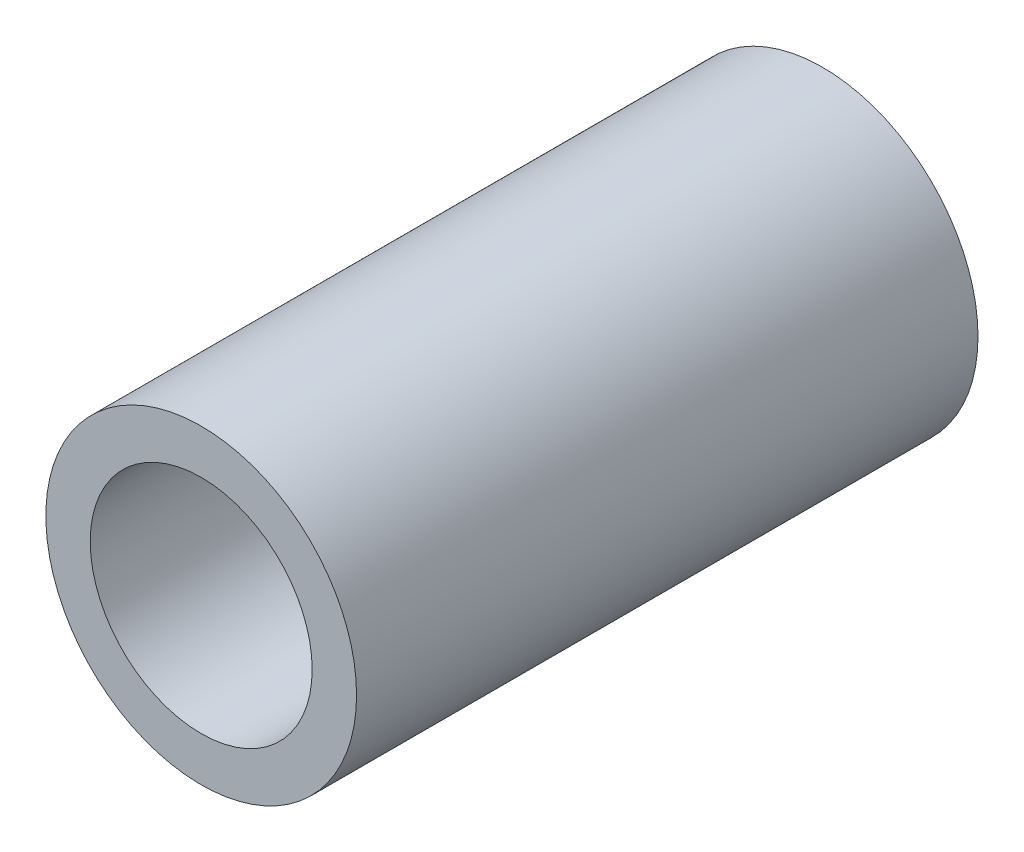
ISO-10303-21;
HEADER;
FILE_DESCRIPTION(('STEP AP214'),'2;1');
FILE_NAME('part.step','',(''),(''),'','','');
FILE_SCHEMA(('AUTOMOTIVE_DESIGN { 1 0 10303 214 1 1 1 1 }'));
ENDSEC;
DATA;
#1=APPLICATION_CONTEXT('core data for automotive mechanical design processes');
#2=APPLICATION_PROTOCOL_DEFINITION('international standard','automotive_design',2000,#1);
#3=PRODUCT_CONTEXT('',#1,'mechanical');
#4=PRODUCT('Part','Part','',(#3));
#5=PRODUCT_RELATED_PRODUCT_CATEGORY('part','',(#4));
#6=PRODUCT_DEFINITION_FORMATION('','',#4);
#7=PRODUCT_DEFINITION_CONTEXT('part definition',#1,'design');
#8=PRODUCT_DEFINITION('design','',#6,#7);
#9=PRODUCT_DEFINITION_SHAPE('','',#8);
#10=(LENGTH_UNIT() NAMED_UNIT(*) SI_UNIT(.MILLI.,.METRE.));
#11=(NAMED_UNIT(*) PLANE_ANGLE_UNIT() SI_UNIT($,.RADIAN.));
#12=(NAMED_UNIT(*) SI_UNIT($,.STERADIAN.) SOLID_ANGLE_UNIT());
#13=UNCERTAINTY_MEASURE_WITH_UNIT(LENGTH_MEASURE(1.E-05),#10,'distance_accuracy_value','');
#14=(GEOMETRIC_REPRESENTATION_CONTEXT(3) GLOBAL_UNCERTAINTY_ASSIGNED_CONTEXT((#13)) GLOBAL_UNIT_ASSIGNED_CONTEXT((#10,
#11,#12)) REPRESENTATION_CONTEXT('',''));
#15=CARTESIAN_POINT('',(0.,0.,0.));
#16=DIRECTION('',(0.,0.,1.));
#17=DIRECTION('',(1.,0.,0.));
#18=AXIS2_PLACEMENT_3D('',#15,#16,#17);
#19=CARTESIAN_POINT('',(0.,0.,-14.));
#20=DIRECTION('',(0.,0.,1.));
#21=DIRECTION('',(1.,0.,0.));
#22=AXIS2_PLACEMENT_3D('',#19,#20,#21);
#23=CYLINDRICAL_SURFACE('',#22,7.);
#24=CARTESIAN_POINT('',(0.,0.,-14.));
#25=DIRECTION('',(0.,0.,1.));
#26=DIRECTION('',(1.,0.,0.));
#27=AXIS2_PLACEMENT_3D('',#24,#25,#26);
#28=CIRCLE('',#27,7.);
#29=CARTESIAN_POINT('',(7.,0.,-14.));
#30=VERTEX_POINT('',#29);
#31=EDGE_CURVE('E10',#30,#30,#28,.T.);
#32=ORIENTED_EDGE('',*,*,#31,.T.);
#33=EDGE_LOOP('',(#32));
#34=FACE_BOUND('',#33,.T.);
#35=CARTESIAN_POINT('',(0.,0.,14.));
#36=DIRECTION('',(0.,0.,1.));
#37=DIRECTION('',(1.,0.,0.));
#38=AXIS2_PLACEMENT_3D('',#35,#36,#37);
#39=CIRCLE('',#38,7.);
#40=CARTESIAN_POINT('',(7.,0.,14.));
#41=VERTEX_POINT('',#40);
#42=EDGE_CURVE('E43',#41,#41,#39,.T.);
#43=ORIENTED_EDGE('',*,*,#42,.F.);
#44=EDGE_LOOP('',(#43));
#45=FACE_BOUND('',#44,.T.);
#46=ADVANCED_FACE('F33',(#34,#45),#23,.T.);
#47=CARTESIAN_POINT('',(0.,0.,-14.));
#48=DIRECTION('',(0.,0.,1.));
#49=DIRECTION('',(1.,0.,0.));
#50=AXIS2_PLACEMENT_3D('',#47,#48,#49);
#51=PLANE('',#50);
#52=CARTESIAN_POINT('',(0.,0.,-14.));
#53=DIRECTION('',(0.,0.,1.));
#54=DIRECTION('',(1.,0.,0.));
#55=AXIS2_PLACEMENT_3D('',#52,#53,#54);
#56=CIRCLE('',#55,5.);
#57=CARTESIAN_POINT('',(5.,0.,-14.));
#58=VERTEX_POINT('',#57);
#59=EDGE_CURVE('E39',#58,#58,#56,.T.);
#60=ORIENTED_EDGE('',*,*,#59,.T.);
#61=EDGE_LOOP('',(#60));
#62=FACE_BOUND('',#61,.T.);
#63=ORIENTED_EDGE('',*,*,#31,.F.);
#64=EDGE_LOOP('',(#63));
#65=FACE_BOUND('',#64,.T.);
#66=ADVANCED_FACE('F62',(#62,#65),#51,.F.);
#67=CARTESIAN_POINT('',(0.,0.,-14.));
#68=DIRECTION('',(0.,0.,1.));
#69=DIRECTION('',(1.,0.,0.));
#70=AXIS2_PLACEMENT_3D('',#67,#68,#69);
#71=CYLINDRICAL_SURFACE('',#70,5.);
#72=ORIENTED_EDGE('',*,*,#59,.F.);
#73=EDGE_LOOP('',(#72));
#74=FACE_BOUND('',#73,.T.);
#75=CARTESIAN_POINT('',(0.,0.,14.));
#76=DIRECTION('',(0.,0.,1.));
#77=DIRECTION('',(1.,0.,0.));
#78=AXIS2_PLACEMENT_3D('',#75,#76,#77);
#79=CIRCLE('',#78,5.);
#80=CARTESIAN_POINT('',(5.,0.,14.));
#81=VERTEX_POINT('',#80);
#82=EDGE_CURVE('E47',#81,#81,#79,.T.);
#83=ORIENTED_EDGE('',*,*,#82,.T.);
#84=EDGE_LOOP('',(#83));
#85=FACE_BOUND('',#84,.T.);
#86=ADVANCED_FACE('F53',(#74,#85),#71,.F.);
#87=CARTESIAN_POINT('',(0.,0.,14.));
#88=DIRECTION('',(0.,0.,1.));
#89=DIRECTION('',(1.,0.,0.));
#90=AXIS2_PLACEMENT_3D('',#87,#88,#89);
#91=PLANE('',#90);
#92=ORIENTED_EDGE('',*,*,#42,.T.);
#93=EDGE_LOOP('',(#92));
#94=FACE_BOUND('',#93,.T.);
#95=ORIENTED_EDGE('',*,*,#82,.F.);
#96=EDGE_LOOP('',(#95));
#97=FACE_BOUND('',#96,.T.);
#98=ADVANCED_FACE('F55',(#94,#97),#91,.T.);
#99=CLOSED_SHELL('',(#46,#66,#86,#98));
#100=MANIFOLD_SOLID_BREP('B2',#99);
#101=ADVANCED_BREP_SHAPE_REPRESENTATION('',(#18,#100),#14);
#102=SHAPE_DEFINITION_REPRESENTATION(#9,#101);
ENDSEC;
END-ISO-10303-21;
